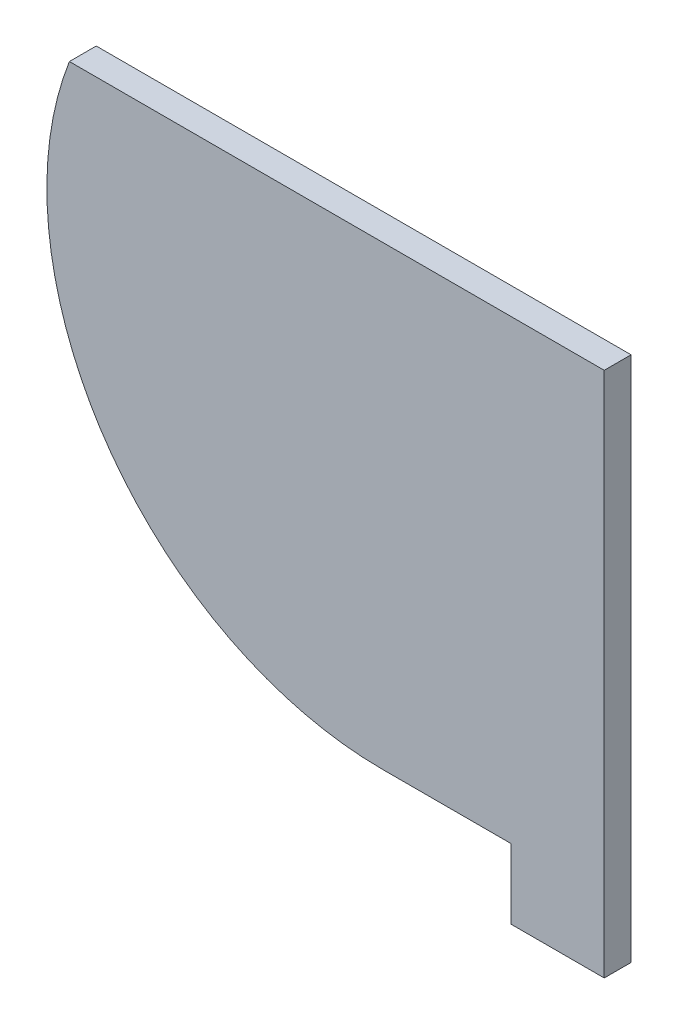
ISO-10303-21;
HEADER;
FILE_DESCRIPTION(('STEP AP214'),'2;1');
FILE_NAME('part.step','',(''),(''),'','','');
FILE_SCHEMA(('AUTOMOTIVE_DESIGN { 1 0 10303 214 1 1 1 1 }'));
ENDSEC;
DATA;
#1=APPLICATION_CONTEXT('core data for automotive mechanical design processes');
#2=APPLICATION_PROTOCOL_DEFINITION('international standard','automotive_design',2000,#1);
#3=PRODUCT_CONTEXT('',#1,'mechanical');
#4=PRODUCT('Part','Part','',(#3));
#5=PRODUCT_RELATED_PRODUCT_CATEGORY('part','',(#4));
#6=PRODUCT_DEFINITION_FORMATION('','',#4);
#7=PRODUCT_DEFINITION_CONTEXT('part definition',#1,'design');
#8=PRODUCT_DEFINITION('design','',#6,#7);
#9=PRODUCT_DEFINITION_SHAPE('','',#8);
#10=(LENGTH_UNIT() NAMED_UNIT(*) SI_UNIT(.MILLI.,.METRE.));
#11=(NAMED_UNIT(*) PLANE_ANGLE_UNIT() SI_UNIT($,.RADIAN.));
#12=(NAMED_UNIT(*) SI_UNIT($,.STERADIAN.) SOLID_ANGLE_UNIT());
#13=UNCERTAINTY_MEASURE_WITH_UNIT(LENGTH_MEASURE(1.E-05),#10,'distance_accuracy_value','');
#14=(GEOMETRIC_REPRESENTATION_CONTEXT(3) GLOBAL_UNCERTAINTY_ASSIGNED_CONTEXT((#13)) GLOBAL_UNIT_ASSIGNED_CONTEXT((#10,
#11,#12)) REPRESENTATION_CONTEXT('',''));
#15=CARTESIAN_POINT('',(0.,0.,0.));
#16=DIRECTION('',(0.,0.,1.));
#17=DIRECTION('',(1.,0.,0.));
#18=AXIS2_PLACEMENT_3D('',#15,#16,#17);
#19=CARTESIAN_POINT('',(-41.2805747146211,-85.,5.));
#20=DIRECTION('',(0.,1.,0.));
#21=DIRECTION('',(0.,0.,1.));
#22=AXIS2_PLACEMENT_3D('',#19,#20,#21);
#23=PLANE('',#22);
#24=DIRECTION('',(1.,0.,0.));
#25=VECTOR('',#24,1.);
#26=CARTESIAN_POINT('',(-41.2805747146211,-85.,0.));
#27=LINE('',#26,#25);
#28=CARTESIAN_POINT('',(-41.2805747146211,-85.,0.));
#29=VERTEX_POINT('',#28);
#30=CARTESIAN_POINT('',(-17.3500000000029,-85.,0.));
#31=VERTEX_POINT('',#30);
#32=EDGE_CURVE('E54',#29,#31,#27,.T.);
#33=ORIENTED_EDGE('',*,*,#32,.T.);
#34=DIRECTION('',(0.,0.,1.));
#35=VECTOR('',#34,1.);
#36=CARTESIAN_POINT('',(-17.3500000000029,-85.,0.));
#37=LINE('',#36,#35);
#38=CARTESIAN_POINT('',(-17.3500000000029,-85.,5.));
#39=VERTEX_POINT('',#38);
#40=EDGE_CURVE('E49',#31,#39,#37,.T.);
#41=ORIENTED_EDGE('',*,*,#40,.T.);
#42=DIRECTION('',(1.,0.,0.));
#43=VECTOR('',#42,1.);
#44=CARTESIAN_POINT('',(-41.2805747146211,-85.,5.));
#45=LINE('',#44,#43);
#46=CARTESIAN_POINT('',(-41.2805747146211,-85.,5.));
#47=VERTEX_POINT('',#46);
#48=EDGE_CURVE('E116',#47,#39,#45,.T.);
#49=ORIENTED_EDGE('',*,*,#48,.F.);
#50=DIRECTION('',(0.,0.,-1.));
#51=VECTOR('',#50,1.);
#52=CARTESIAN_POINT('',(-41.2805747146211,-85.,5.));
#53=LINE('',#52,#51);
#54=EDGE_CURVE('E125',#47,#29,#53,.T.);
#55=ORIENTED_EDGE('',*,*,#54,.T.);
#56=EDGE_LOOP('',(#33,#41,#49,#55));
#57=FACE_BOUND('',#56,.T.);
#58=ADVANCED_FACE('F35',(#57),#23,.F.);
#59=CARTESIAN_POINT('',(0.,0.,5.));
#60=DIRECTION('',(-1.,0.,0.));
#61=DIRECTION('',(0.,-1.,0.));
#62=AXIS2_PLACEMENT_3D('',#59,#60,#61);
#63=PLANE('',#62);
#64=DIRECTION('',(0.,1.,0.));
#65=VECTOR('',#64,1.);
#66=CARTESIAN_POINT('',(0.,0.,0.));
#67=LINE('',#66,#65);
#68=CARTESIAN_POINT('',(0.,-97.9999999999996,0.));
#69=VERTEX_POINT('',#68);
#70=CARTESIAN_POINT('',(0.,0.,0.));
#71=VERTEX_POINT('',#70);
#72=EDGE_CURVE('E105',#69,#71,#67,.T.);
#73=ORIENTED_EDGE('',*,*,#72,.T.);
#74=DIRECTION('',(0.,0.,-1.));
#75=VECTOR('',#74,1.);
#76=CARTESIAN_POINT('',(0.,0.,5.));
#77=LINE('',#76,#75);
#78=CARTESIAN_POINT('',(0.,0.,5.));
#79=VERTEX_POINT('',#78);
#80=EDGE_CURVE('E11',#79,#71,#77,.T.);
#81=ORIENTED_EDGE('',*,*,#80,.F.);
#82=DIRECTION('',(0.,1.,0.));
#83=VECTOR('',#82,1.);
#84=CARTESIAN_POINT('',(0.,0.,5.));
#85=LINE('',#84,#83);
#86=CARTESIAN_POINT('',(0.,-97.9999999999996,5.));
#87=VERTEX_POINT('',#86);
#88=EDGE_CURVE('E118',#87,#79,#85,.T.);
#89=ORIENTED_EDGE('',*,*,#88,.F.);
#90=DIRECTION('',(0.,0.,1.));
#91=VECTOR('',#90,1.);
#92=CARTESIAN_POINT('',(0.,-97.9999999999996,0.));
#93=LINE('',#92,#91);
#94=EDGE_CURVE('E98',#69,#87,#93,.T.);
#95=ORIENTED_EDGE('',*,*,#94,.F.);
#96=EDGE_LOOP('',(#73,#81,#89,#95));
#97=FACE_BOUND('',#96,.T.);
#98=ADVANCED_FACE('F143',(#97),#63,.F.);
#99=CARTESIAN_POINT('',(0.,0.,5.));
#100=DIRECTION('',(0.,-1.,0.));
#101=DIRECTION('',(1.,0.,0.));
#102=AXIS2_PLACEMENT_3D('',#99,#100,#101);
#103=PLANE('',#102);
#104=DIRECTION('',(-1.,0.,0.));
#105=VECTOR('',#104,1.);
#106=CARTESIAN_POINT('',(0.,0.,0.));
#107=LINE('',#106,#105);
#108=CARTESIAN_POINT('',(-99.5900936630741,0.,0.));
#109=VERTEX_POINT('',#108);
#110=EDGE_CURVE('E128',#71,#109,#107,.T.);
#111=ORIENTED_EDGE('',*,*,#110,.T.);
#112=DIRECTION('',(0.,0.,-1.));
#113=VECTOR('',#112,1.);
#114=CARTESIAN_POINT('',(-99.5900936630741,0.,5.));
#115=LINE('',#114,#113);
#116=CARTESIAN_POINT('',(-99.5900936630741,0.,5.));
#117=VERTEX_POINT('',#116);
#118=EDGE_CURVE('E42',#117,#109,#115,.T.);
#119=ORIENTED_EDGE('',*,*,#118,.F.);
#120=DIRECTION('',(-1.,0.,0.));
#121=VECTOR('',#120,1.);
#122=CARTESIAN_POINT('',(0.,0.,5.));
#123=LINE('',#122,#121);
#124=EDGE_CURVE('E121',#79,#117,#123,.T.);
#125=ORIENTED_EDGE('',*,*,#124,.F.);
#126=ORIENTED_EDGE('',*,*,#80,.T.);
#127=EDGE_LOOP('',(#111,#119,#125,#126));
#128=FACE_BOUND('',#127,.T.);
#129=ADVANCED_FACE('F140',(#128),#103,.F.);
#130=CARTESIAN_POINT('',(-41.2805747146211,-22.5,5.));
#131=DIRECTION('',(0.,0.,-1.));
#132=DIRECTION('',(-1.,0.,0.));
#133=AXIS2_PLACEMENT_3D('',#130,#131,#132);
#134=CYLINDRICAL_SURFACE('',#133,62.5);
#135=CARTESIAN_POINT('',(-41.2805747146211,-22.5,0.));
#136=DIRECTION('',(0.,0.,1.));
#137=DIRECTION('',(1.,0.,0.));
#138=AXIS2_PLACEMENT_3D('',#135,#136,#137);
#139=CIRCLE('',#138,62.5);
#140=EDGE_CURVE('E119',#109,#29,#139,.T.);
#141=ORIENTED_EDGE('',*,*,#140,.T.);
#142=ORIENTED_EDGE('',*,*,#54,.F.);
#143=CARTESIAN_POINT('',(-41.2805747146211,-22.5,5.));
#144=DIRECTION('',(0.,0.,1.));
#145=DIRECTION('',(1.,0.,0.));
#146=AXIS2_PLACEMENT_3D('',#143,#144,#145);
#147=CIRCLE('',#146,62.5);
#148=EDGE_CURVE('E123',#117,#47,#147,.T.);
#149=ORIENTED_EDGE('',*,*,#148,.F.);
#150=ORIENTED_EDGE('',*,*,#118,.T.);
#151=EDGE_LOOP('',(#141,#142,#149,#150));
#152=FACE_BOUND('',#151,.T.);
#153=ADVANCED_FACE('F136',(#152),#134,.T.);
#154=CARTESIAN_POINT('',(-41.2805747146211,-22.5,5.));
#155=DIRECTION('',(0.,0.,1.));
#156=DIRECTION('',(1.,0.,0.));
#157=AXIS2_PLACEMENT_3D('',#154,#155,#156);
#158=PLANE('',#157);
#159=ORIENTED_EDGE('',*,*,#48,.T.);
#160=DIRECTION('',(0.,-1.,0.));
#161=VECTOR('',#160,1.);
#162=CARTESIAN_POINT('',(-17.3500000000029,-85.,5.));
#163=LINE('',#162,#161);
#164=CARTESIAN_POINT('',(-17.3500000000029,-97.9999999999996,5.));
#165=VERTEX_POINT('',#164);
#166=EDGE_CURVE('E110',#39,#165,#163,.T.);
#167=ORIENTED_EDGE('',*,*,#166,.T.);
#168=DIRECTION('',(1.,0.,0.));
#169=VECTOR('',#168,1.);
#170=CARTESIAN_POINT('',(-17.3500000000029,-97.9999999999996,5.));
#171=LINE('',#170,#169);
#172=EDGE_CURVE('E93',#165,#87,#171,.T.);
#173=ORIENTED_EDGE('',*,*,#172,.T.);
#174=ORIENTED_EDGE('',*,*,#88,.T.);
#175=ORIENTED_EDGE('',*,*,#124,.T.);
#176=ORIENTED_EDGE('',*,*,#148,.T.);
#177=EDGE_LOOP('',(#159,#167,#173,#174,#175,#176));
#178=FACE_BOUND('',#177,.T.);
#179=ADVANCED_FACE('F145',(#178),#158,.T.);
#180=CARTESIAN_POINT('',(-41.2805747146211,-22.5,0.));
#181=DIRECTION('',(0.,0.,1.));
#182=DIRECTION('',(1.,0.,0.));
#183=AXIS2_PLACEMENT_3D('',#180,#181,#182);
#184=PLANE('',#183);
#185=ORIENTED_EDGE('',*,*,#32,.F.);
#186=ORIENTED_EDGE('',*,*,#140,.F.);
#187=ORIENTED_EDGE('',*,*,#110,.F.);
#188=ORIENTED_EDGE('',*,*,#72,.F.);
#189=DIRECTION('',(1.,0.,0.));
#190=VECTOR('',#189,1.);
#191=CARTESIAN_POINT('',(-17.3500000000029,-97.9999999999996,0.));
#192=LINE('',#191,#190);
#193=CARTESIAN_POINT('',(-17.3500000000029,-97.9999999999996,0.));
#194=VERTEX_POINT('',#193);
#195=EDGE_CURVE('E91',#194,#69,#192,.T.);
#196=ORIENTED_EDGE('',*,*,#195,.F.);
#197=DIRECTION('',(0.,-1.,0.));
#198=VECTOR('',#197,1.);
#199=CARTESIAN_POINT('',(-17.3500000000029,-85.,0.));
#200=LINE('',#199,#198);
#201=EDGE_CURVE('E103',#31,#194,#200,.T.);
#202=ORIENTED_EDGE('',*,*,#201,.F.);
#203=EDGE_LOOP('',(#185,#186,#187,#188,#196,#202));
#204=FACE_BOUND('',#203,.T.);
#205=ADVANCED_FACE('F102',(#204),#184,.F.);
#206=CARTESIAN_POINT('',(-17.3500000000029,-97.9999999999996,0.));
#207=DIRECTION('',(0.,-1.,0.));
#208=DIRECTION('',(0.,0.,-1.));
#209=AXIS2_PLACEMENT_3D('',#206,#207,#208);
#210=PLANE('',#209);
#211=ORIENTED_EDGE('',*,*,#172,.F.);
#212=DIRECTION('',(0.,0.,1.));
#213=VECTOR('',#212,1.);
#214=CARTESIAN_POINT('',(-17.3500000000029,-97.9999999999996,0.));
#215=LINE('',#214,#213);
#216=EDGE_CURVE('E87',#194,#165,#215,.T.);
#217=ORIENTED_EDGE('',*,*,#216,.F.);
#218=ORIENTED_EDGE('',*,*,#195,.T.);
#219=ORIENTED_EDGE('',*,*,#94,.T.);
#220=EDGE_LOOP('',(#211,#217,#218,#219));
#221=FACE_BOUND('',#220,.T.);
#222=ADVANCED_FACE('F89',(#221),#210,.T.);
#223=CARTESIAN_POINT('',(-17.3500000000029,-85.,0.));
#224=DIRECTION('',(-1.,0.,0.));
#225=DIRECTION('',(0.,0.,1.));
#226=AXIS2_PLACEMENT_3D('',#223,#224,#225);
#227=PLANE('',#226);
#228=ORIENTED_EDGE('',*,*,#166,.F.);
#229=ORIENTED_EDGE('',*,*,#40,.F.);
#230=ORIENTED_EDGE('',*,*,#201,.T.);
#231=ORIENTED_EDGE('',*,*,#216,.T.);
#232=EDGE_LOOP('',(#228,#229,#230,#231));
#233=FACE_BOUND('',#232,.T.);
#234=ADVANCED_FACE('F108',(#233),#227,.T.);
#235=CLOSED_SHELL('',(#58,#98,#129,#153,#179,#205,#222,#234));
#236=MANIFOLD_SOLID_BREP('B2',#235);
#237=ADVANCED_BREP_SHAPE_REPRESENTATION('',(#18,#236),#14);
#238=SHAPE_DEFINITION_REPRESENTATION(#9,#237);
ENDSEC;
END-ISO-10303-21;
